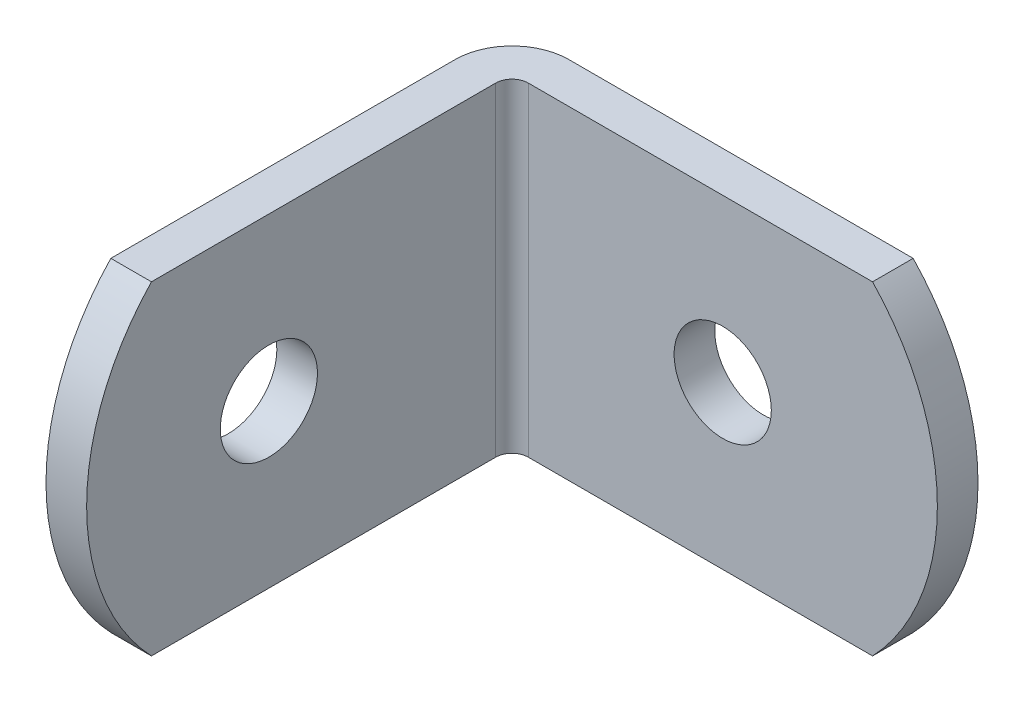
ISO-10303-21;
HEADER;
FILE_DESCRIPTION(('STEP AP214'),'2;1');
FILE_NAME('part.step','',(''),(''),'','','');
FILE_SCHEMA(('AUTOMOTIVE_DESIGN { 1 0 10303 214 1 1 1 1 }'));
ENDSEC;
DATA;
#1=APPLICATION_CONTEXT('core data for automotive mechanical design processes');
#2=APPLICATION_PROTOCOL_DEFINITION('international standard','automotive_design',2000,#1);
#3=PRODUCT_CONTEXT('',#1,'mechanical');
#4=PRODUCT('Part','Part','',(#3));
#5=PRODUCT_RELATED_PRODUCT_CATEGORY('part','',(#4));
#6=PRODUCT_DEFINITION_FORMATION('','',#4);
#7=PRODUCT_DEFINITION_CONTEXT('part definition',#1,'design');
#8=PRODUCT_DEFINITION('design','',#6,#7);
#9=PRODUCT_DEFINITION_SHAPE('','',#8);
#10=(LENGTH_UNIT() NAMED_UNIT(*) SI_UNIT(.MILLI.,.METRE.));
#11=(NAMED_UNIT(*) PLANE_ANGLE_UNIT() SI_UNIT($,.RADIAN.));
#12=(NAMED_UNIT(*) SI_UNIT($,.STERADIAN.) SOLID_ANGLE_UNIT());
#13=UNCERTAINTY_MEASURE_WITH_UNIT(LENGTH_MEASURE(1.E-05),#10,'distance_accuracy_value','');
#14=(GEOMETRIC_REPRESENTATION_CONTEXT(3) GLOBAL_UNCERTAINTY_ASSIGNED_CONTEXT((#13)) GLOBAL_UNIT_ASSIGNED_CONTEXT((#10,
#11,#12)) REPRESENTATION_CONTEXT('',''));
#15=CARTESIAN_POINT('',(0.,0.,0.));
#16=DIRECTION('',(0.,0.,1.));
#17=DIRECTION('',(1.,0.,0.));
#18=AXIS2_PLACEMENT_3D('',#15,#16,#17);
#19=CARTESIAN_POINT('',(73.5960459180228,0.,11.41095));
#20=DIRECTION('',(-1.,0.,0.));
#21=DIRECTION('',(0.,0.,1.));
#22=AXIS2_PLACEMENT_3D('',#19,#20,#21);
#23=CYLINDRICAL_SURFACE('',#22,11.60145);
#24=DIRECTION('',(-1.,0.,0.));
#25=VECTOR('',#24,1.);
#26=CARTESIAN_POINT('',(73.5960459180228,-8.001,19.812));
#27=LINE('',#26,#25);
#28=CARTESIAN_POINT('',(0.,-8.001,19.812));
#29=VERTEX_POINT('',#28);
#30=CARTESIAN_POINT('',(2.0066,-8.001,19.812));
#31=VERTEX_POINT('',#30);
#32=EDGE_CURVE('E50',#29,#31,#27,.F.);
#33=ORIENTED_EDGE('',*,*,#32,.T.);
#34=CARTESIAN_POINT('',(2.0066,0.,11.41095));
#35=DIRECTION('',(-1.,0.,0.));
#36=DIRECTION('',(0.,0.,1.));
#37=AXIS2_PLACEMENT_3D('',#34,#35,#36);
#38=CIRCLE('',#37,11.60145);
#39=CARTESIAN_POINT('',(2.0066,8.001,19.812));
#40=VERTEX_POINT('',#39);
#41=EDGE_CURVE('E144',#40,#31,#38,.F.);
#42=ORIENTED_EDGE('',*,*,#41,.F.);
#43=DIRECTION('',(-1.,0.,0.));
#44=VECTOR('',#43,1.);
#45=CARTESIAN_POINT('',(73.5960459180228,8.001,19.812));
#46=LINE('',#45,#44);
#47=CARTESIAN_POINT('',(0.,8.001,19.812));
#48=VERTEX_POINT('',#47);
#49=EDGE_CURVE('E139',#40,#48,#46,.T.);
#50=ORIENTED_EDGE('',*,*,#49,.T.);
#51=CARTESIAN_POINT('',(0.,0.,11.41095));
#52=DIRECTION('',(-1.,0.,0.));
#53=DIRECTION('',(0.,0.,1.));
#54=AXIS2_PLACEMENT_3D('',#51,#52,#53);
#55=CIRCLE('',#54,11.60145);
#56=EDGE_CURVE('E147',#48,#29,#55,.F.);
#57=ORIENTED_EDGE('',*,*,#56,.T.);
#58=EDGE_LOOP('',(#33,#42,#50,#57));
#59=FACE_BOUND('',#58,.T.);
#60=ADVANCED_FACE('F41',(#59),#23,.T.);
#61=CARTESIAN_POINT('',(2.80924,8.001,2.0066));
#62=DIRECTION('',(0.,0.,-1.));
#63=DIRECTION('',(-1.,0.,0.));
#64=AXIS2_PLACEMENT_3D('',#61,#62,#63);
#65=PLANE('',#64);
#66=CARTESIAN_POINT('',(12.4124,0.,2.0066));
#67=DIRECTION('',(0.,0.,1.));
#68=DIRECTION('',(1.,0.,0.));
#69=AXIS2_PLACEMENT_3D('',#66,#67,#68);
#70=CIRCLE('',#69,2.4);
#71=CARTESIAN_POINT('',(14.8124,0.,2.0066));
#72=VERTEX_POINT('',#71);
#73=EDGE_CURVE('E218',#72,#72,#70,.T.);
#74=ORIENTED_EDGE('',*,*,#73,.F.);
#75=EDGE_LOOP('',(#74));
#76=FACE_BOUND('',#75,.T.);
#77=DIRECTION('',(1.,0.,0.));
#78=VECTOR('',#77,1.);
#79=CARTESIAN_POINT('',(2.80924,-8.001,2.0066));
#80=LINE('',#79,#78);
#81=CARTESIAN_POINT('',(2.80924,-8.001,2.0066));
#82=VERTEX_POINT('',#81);
#83=CARTESIAN_POINT('',(19.812,-8.001,2.0066));
#84=VERTEX_POINT('',#83);
#85=EDGE_CURVE('E117',#82,#84,#80,.T.);
#86=ORIENTED_EDGE('',*,*,#85,.T.);
#87=CARTESIAN_POINT('',(11.41095,0.,2.0066));
#88=DIRECTION('',(0.,0.,-1.));
#89=DIRECTION('',(-1.,0.,0.));
#90=AXIS2_PLACEMENT_3D('',#87,#88,#89);
#91=CIRCLE('',#90,11.60145);
#92=CARTESIAN_POINT('',(19.812,8.001,2.0066));
#93=VERTEX_POINT('',#92);
#94=EDGE_CURVE('E64',#84,#93,#91,.F.);
#95=ORIENTED_EDGE('',*,*,#94,.T.);
#96=DIRECTION('',(1.,0.,0.));
#97=VECTOR('',#96,1.);
#98=CARTESIAN_POINT('',(2.80924,8.001,2.0066));
#99=LINE('',#98,#97);
#100=CARTESIAN_POINT('',(2.80924,8.001,2.0066));
#101=VERTEX_POINT('',#100);
#102=EDGE_CURVE('E151',#101,#93,#99,.T.);
#103=ORIENTED_EDGE('',*,*,#102,.F.);
#104=DIRECTION('',(0.,-1.,0.));
#105=VECTOR('',#104,1.);
#106=CARTESIAN_POINT('',(2.80924,8.001,2.0066));
#107=LINE('',#106,#105);
#108=EDGE_CURVE('E170',#101,#82,#107,.T.);
#109=ORIENTED_EDGE('',*,*,#108,.T.);
#110=EDGE_LOOP('',(#86,#95,#103,#109));
#111=FACE_BOUND('',#110,.T.);
#112=ADVANCED_FACE('F43',(#76,#111),#65,.F.);
#113=CARTESIAN_POINT('',(2.80924,8.001,0.));
#114=DIRECTION('',(0.,0.,-1.));
#115=DIRECTION('',(-1.,0.,0.));
#116=AXIS2_PLACEMENT_3D('',#113,#114,#115);
#117=PLANE('',#116);
#118=CARTESIAN_POINT('',(12.4124,0.,0.));
#119=DIRECTION('',(0.,0.,1.));
#120=DIRECTION('',(1.,0.,0.));
#121=AXIS2_PLACEMENT_3D('',#118,#119,#120);
#122=CIRCLE('',#121,2.4);
#123=CARTESIAN_POINT('',(14.8124,0.,0.));
#124=VERTEX_POINT('',#123);
#125=EDGE_CURVE('E214',#124,#124,#122,.T.);
#126=ORIENTED_EDGE('',*,*,#125,.T.);
#127=EDGE_LOOP('',(#126));
#128=FACE_BOUND('',#127,.T.);
#129=CARTESIAN_POINT('',(11.41095,0.,0.));
#130=DIRECTION('',(0.,0.,-1.));
#131=DIRECTION('',(-1.,0.,0.));
#132=AXIS2_PLACEMENT_3D('',#129,#130,#131);
#133=CIRCLE('',#132,11.60145);
#134=CARTESIAN_POINT('',(19.812,-8.001,0.));
#135=VERTEX_POINT('',#134);
#136=CARTESIAN_POINT('',(19.812,8.001,0.));
#137=VERTEX_POINT('',#136);
#138=EDGE_CURVE('E56',#135,#137,#133,.F.);
#139=ORIENTED_EDGE('',*,*,#138,.F.);
#140=DIRECTION('',(1.,0.,0.));
#141=VECTOR('',#140,1.);
#142=CARTESIAN_POINT('',(2.80924,-8.001,0.));
#143=LINE('',#142,#141);
#144=CARTESIAN_POINT('',(2.80924,-8.001,0.));
#145=VERTEX_POINT('',#144);
#146=EDGE_CURVE('E110',#145,#135,#143,.T.);
#147=ORIENTED_EDGE('',*,*,#146,.F.);
#148=DIRECTION('',(0.,-1.,0.));
#149=VECTOR('',#148,1.);
#150=CARTESIAN_POINT('',(2.80924,8.001,0.));
#151=LINE('',#150,#149);
#152=CARTESIAN_POINT('',(2.80924,8.001,0.));
#153=VERTEX_POINT('',#152);
#154=EDGE_CURVE('E194',#153,#145,#151,.T.);
#155=ORIENTED_EDGE('',*,*,#154,.F.);
#156=DIRECTION('',(1.,0.,0.));
#157=VECTOR('',#156,1.);
#158=CARTESIAN_POINT('',(2.80924,8.001,0.));
#159=LINE('',#158,#157);
#160=EDGE_CURVE('E122',#153,#137,#159,.T.);
#161=ORIENTED_EDGE('',*,*,#160,.T.);
#162=EDGE_LOOP('',(#139,#147,#155,#161));
#163=FACE_BOUND('',#162,.T.);
#164=ADVANCED_FACE('F120',(#128,#163),#117,.T.);
#165=CARTESIAN_POINT('',(2.80924,8.001,2.80924));
#166=DIRECTION('',(0.,-1.,0.));
#167=DIRECTION('',(0.,0.,-1.));
#168=AXIS2_PLACEMENT_3D('',#165,#166,#167);
#169=CYLINDRICAL_SURFACE('',#168,2.80924);
#170=CARTESIAN_POINT('',(2.80924,-8.001,2.80924));
#171=DIRECTION('',(0.,-1.,0.));
#172=DIRECTION('',(0.,0.,1.));
#173=AXIS2_PLACEMENT_3D('',#170,#171,#172);
#174=CIRCLE('',#173,2.80924);
#175=CARTESIAN_POINT('',(0.,-8.001,2.80924));
#176=VERTEX_POINT('',#175);
#177=EDGE_CURVE('E114',#176,#145,#174,.T.);
#178=ORIENTED_EDGE('',*,*,#177,.F.);
#179=DIRECTION('',(0.,-1.,0.));
#180=VECTOR('',#179,1.);
#181=CARTESIAN_POINT('',(0.,8.001,2.80924));
#182=LINE('',#181,#180);
#183=CARTESIAN_POINT('',(0.,8.001,2.80924));
#184=VERTEX_POINT('',#183);
#185=EDGE_CURVE('E190',#184,#176,#182,.T.);
#186=ORIENTED_EDGE('',*,*,#185,.F.);
#187=CARTESIAN_POINT('',(2.80924,8.001,2.80924));
#188=DIRECTION('',(0.,-1.,0.));
#189=DIRECTION('',(0.,0.,1.));
#190=AXIS2_PLACEMENT_3D('',#187,#188,#189);
#191=CIRCLE('',#190,2.80924);
#192=EDGE_CURVE('E157',#184,#153,#191,.T.);
#193=ORIENTED_EDGE('',*,*,#192,.T.);
#194=ORIENTED_EDGE('',*,*,#154,.T.);
#195=EDGE_LOOP('',(#178,#186,#193,#194));
#196=FACE_BOUND('',#195,.T.);
#197=ADVANCED_FACE('F210',(#196),#169,.T.);
#198=CARTESIAN_POINT('',(0.,8.001,2.80924));
#199=DIRECTION('',(-1.,0.,0.));
#200=DIRECTION('',(0.,0.,1.));
#201=AXIS2_PLACEMENT_3D('',#198,#199,#200);
#202=PLANE('',#201);
#203=CARTESIAN_POINT('',(0.,0.,14.0124));
#204=DIRECTION('',(1.,0.,0.));
#205=DIRECTION('',(0.,0.,-1.));
#206=AXIS2_PLACEMENT_3D('',#203,#204,#205);
#207=CIRCLE('',#206,2.4);
#208=CARTESIAN_POINT('',(0.,0.,11.6124));
#209=VERTEX_POINT('',#208);
#210=EDGE_CURVE('E133',#209,#209,#207,.T.);
#211=ORIENTED_EDGE('',*,*,#210,.T.);
#212=EDGE_LOOP('',(#211));
#213=FACE_BOUND('',#212,.T.);
#214=ORIENTED_EDGE('',*,*,#56,.F.);
#215=DIRECTION('',(0.,0.,-1.));
#216=VECTOR('',#215,1.);
#217=CARTESIAN_POINT('',(0.,8.001,2.80924));
#218=LINE('',#217,#216);
#219=EDGE_CURVE('E161',#48,#184,#218,.T.);
#220=ORIENTED_EDGE('',*,*,#219,.T.);
#221=ORIENTED_EDGE('',*,*,#185,.T.);
#222=DIRECTION('',(0.,0.,-1.));
#223=VECTOR('',#222,1.);
#224=CARTESIAN_POINT('',(0.,-8.001,2.80924));
#225=LINE('',#224,#223);
#226=EDGE_CURVE('E175',#29,#176,#225,.T.);
#227=ORIENTED_EDGE('',*,*,#226,.F.);
#228=EDGE_LOOP('',(#214,#220,#221,#227));
#229=FACE_BOUND('',#228,.T.);
#230=ADVANCED_FACE('F205',(#213,#229),#202,.T.);
#231=CARTESIAN_POINT('',(2.0066,8.001,2.80924));
#232=DIRECTION('',(-1.,0.,0.));
#233=DIRECTION('',(0.,0.,1.));
#234=AXIS2_PLACEMENT_3D('',#231,#232,#233);
#235=PLANE('',#234);
#236=CARTESIAN_POINT('',(2.0066,0.,14.0124));
#237=DIRECTION('',(1.,0.,0.));
#238=DIRECTION('',(0.,0.,-1.));
#239=AXIS2_PLACEMENT_3D('',#236,#237,#238);
#240=CIRCLE('',#239,2.4);
#241=CARTESIAN_POINT('',(2.0066,0.,11.6124));
#242=VERTEX_POINT('',#241);
#243=EDGE_CURVE('E128',#242,#242,#240,.T.);
#244=ORIENTED_EDGE('',*,*,#243,.F.);
#245=EDGE_LOOP('',(#244));
#246=FACE_BOUND('',#245,.T.);
#247=ORIENTED_EDGE('',*,*,#41,.T.);
#248=DIRECTION('',(0.,0.,-1.));
#249=VECTOR('',#248,1.);
#250=CARTESIAN_POINT('',(2.0066,-8.001,2.80924));
#251=LINE('',#250,#249);
#252=CARTESIAN_POINT('',(2.0066,-8.001,2.80924));
#253=VERTEX_POINT('',#252);
#254=EDGE_CURVE('E178',#31,#253,#251,.T.);
#255=ORIENTED_EDGE('',*,*,#254,.T.);
#256=DIRECTION('',(0.,-1.,0.));
#257=VECTOR('',#256,1.);
#258=CARTESIAN_POINT('',(2.0066,8.001,2.80924));
#259=LINE('',#258,#257);
#260=CARTESIAN_POINT('',(2.0066,8.001,2.80924));
#261=VERTEX_POINT('',#260);
#262=EDGE_CURVE('E186',#261,#253,#259,.T.);
#263=ORIENTED_EDGE('',*,*,#262,.F.);
#264=DIRECTION('',(0.,0.,-1.));
#265=VECTOR('',#264,1.);
#266=CARTESIAN_POINT('',(2.0066,8.001,2.80924));
#267=LINE('',#266,#265);
#268=EDGE_CURVE('E164',#40,#261,#267,.T.);
#269=ORIENTED_EDGE('',*,*,#268,.F.);
#270=EDGE_LOOP('',(#247,#255,#263,#269));
#271=FACE_BOUND('',#270,.T.);
#272=ADVANCED_FACE('F236',(#246,#271),#235,.F.);
#273=CARTESIAN_POINT('',(2.80924,8.001,2.80924));
#274=DIRECTION('',(0.,-1.,0.));
#275=DIRECTION('',(0.,0.,-1.));
#276=AXIS2_PLACEMENT_3D('',#273,#274,#275);
#277=CYLINDRICAL_SURFACE('',#276,0.80264);
#278=CARTESIAN_POINT('',(2.80924,-8.001,2.80924));
#279=DIRECTION('',(0.,1.,0.));
#280=DIRECTION('',(1.,0.,0.));
#281=AXIS2_PLACEMENT_3D('',#278,#279,#280);
#282=CIRCLE('',#281,0.80264);
#283=EDGE_CURVE('E154',#253,#82,#282,.F.);
#284=ORIENTED_EDGE('',*,*,#283,.T.);
#285=ORIENTED_EDGE('',*,*,#108,.F.);
#286=CARTESIAN_POINT('',(2.80924,8.001,2.80924));
#287=DIRECTION('',(0.,1.,0.));
#288=DIRECTION('',(1.,0.,0.));
#289=AXIS2_PLACEMENT_3D('',#286,#287,#288);
#290=CIRCLE('',#289,0.80264);
#291=EDGE_CURVE('E167',#261,#101,#290,.F.);
#292=ORIENTED_EDGE('',*,*,#291,.F.);
#293=ORIENTED_EDGE('',*,*,#262,.T.);
#294=EDGE_LOOP('',(#284,#285,#292,#293));
#295=FACE_BOUND('',#294,.T.);
#296=ADVANCED_FACE('F231',(#295),#277,.F.);
#297=CARTESIAN_POINT('',(2.80924,8.001,2.80924));
#298=DIRECTION('',(0.,-1.,0.));
#299=DIRECTION('',(-1.,0.,0.));
#300=AXIS2_PLACEMENT_3D('',#297,#298,#299);
#301=PLANE('',#300);
#302=ORIENTED_EDGE('',*,*,#102,.T.);
#303=DIRECTION('',(0.,0.,-1.));
#304=VECTOR('',#303,1.);
#305=CARTESIAN_POINT('',(19.812,8.001,69.5955459180228));
#306=LINE('',#305,#304);
#307=EDGE_CURVE('E124',#93,#137,#306,.T.);
#308=ORIENTED_EDGE('',*,*,#307,.T.);
#309=ORIENTED_EDGE('',*,*,#160,.F.);
#310=ORIENTED_EDGE('',*,*,#192,.F.);
#311=ORIENTED_EDGE('',*,*,#219,.F.);
#312=ORIENTED_EDGE('',*,*,#49,.F.);
#313=ORIENTED_EDGE('',*,*,#268,.T.);
#314=ORIENTED_EDGE('',*,*,#291,.T.);
#315=EDGE_LOOP('',(#302,#308,#309,#310,#311,#312,#313,#314));
#316=FACE_BOUND('',#315,.T.);
#317=ADVANCED_FACE('F212',(#316),#301,.F.);
#318=CARTESIAN_POINT('',(2.80924,-8.001,2.80924));
#319=DIRECTION('',(0.,-1.,0.));
#320=DIRECTION('',(-1.,0.,0.));
#321=AXIS2_PLACEMENT_3D('',#318,#319,#320);
#322=PLANE('',#321);
#323=DIRECTION('',(0.,0.,-1.));
#324=VECTOR('',#323,1.);
#325=CARTESIAN_POINT('',(19.812,-8.001,69.5955459180228));
#326=LINE('',#325,#324);
#327=EDGE_CURVE('E11',#84,#135,#326,.T.);
#328=ORIENTED_EDGE('',*,*,#327,.F.);
#329=ORIENTED_EDGE('',*,*,#85,.F.);
#330=ORIENTED_EDGE('',*,*,#283,.F.);
#331=ORIENTED_EDGE('',*,*,#254,.F.);
#332=ORIENTED_EDGE('',*,*,#32,.F.);
#333=ORIENTED_EDGE('',*,*,#226,.T.);
#334=ORIENTED_EDGE('',*,*,#177,.T.);
#335=ORIENTED_EDGE('',*,*,#146,.T.);
#336=EDGE_LOOP('',(#328,#329,#330,#331,#332,#333,#334,#335));
#337=FACE_BOUND('',#336,.T.);
#338=ADVANCED_FACE('F111',(#337),#322,.T.);
#339=CARTESIAN_POINT('',(0.,0.,14.0124));
#340=DIRECTION('',(1.,0.,0.));
#341=DIRECTION('',(0.,0.,-1.));
#342=AXIS2_PLACEMENT_3D('',#339,#340,#341);
#343=CYLINDRICAL_SURFACE('',#342,2.4);
#344=ORIENTED_EDGE('',*,*,#210,.F.);
#345=EDGE_LOOP('',(#344));
#346=FACE_BOUND('',#345,.T.);
#347=ORIENTED_EDGE('',*,*,#243,.T.);
#348=EDGE_LOOP('',(#347));
#349=FACE_BOUND('',#348,.T.);
#350=ADVANCED_FACE('F254',(#346,#349),#343,.F.);
#351=CARTESIAN_POINT('',(11.41095,0.,69.5955459180228));
#352=DIRECTION('',(0.,0.,-1.));
#353=DIRECTION('',(-1.,0.,0.));
#354=AXIS2_PLACEMENT_3D('',#351,#352,#353);
#355=CYLINDRICAL_SURFACE('',#354,11.60145);
#356=ORIENTED_EDGE('',*,*,#94,.F.);
#357=ORIENTED_EDGE('',*,*,#327,.T.);
#358=ORIENTED_EDGE('',*,*,#138,.T.);
#359=ORIENTED_EDGE('',*,*,#307,.F.);
#360=EDGE_LOOP('',(#356,#357,#358,#359));
#361=FACE_BOUND('',#360,.T.);
#362=ADVANCED_FACE('F126',(#361),#355,.T.);
#363=CARTESIAN_POINT('',(12.4124,0.,0.));
#364=DIRECTION('',(0.,0.,1.));
#365=DIRECTION('',(1.,0.,0.));
#366=AXIS2_PLACEMENT_3D('',#363,#364,#365);
#367=CYLINDRICAL_SURFACE('',#366,2.4);
#368=ORIENTED_EDGE('',*,*,#125,.F.);
#369=EDGE_LOOP('',(#368));
#370=FACE_BOUND('',#369,.T.);
#371=ORIENTED_EDGE('',*,*,#73,.T.);
#372=EDGE_LOOP('',(#371));
#373=FACE_BOUND('',#372,.T.);
#374=ADVANCED_FACE('F226',(#370,#373),#367,.F.);
#375=CLOSED_SHELL('',(#60,#112,#164,#197,#230,#272,#296,#317,#338,#350,#362,#374));
#376=MANIFOLD_SOLID_BREP('B2',#375);
#377=ADVANCED_BREP_SHAPE_REPRESENTATION('',(#18,#376),#14);
#378=SHAPE_DEFINITION_REPRESENTATION(#9,#377);
ENDSEC;
END-ISO-10303-21;
